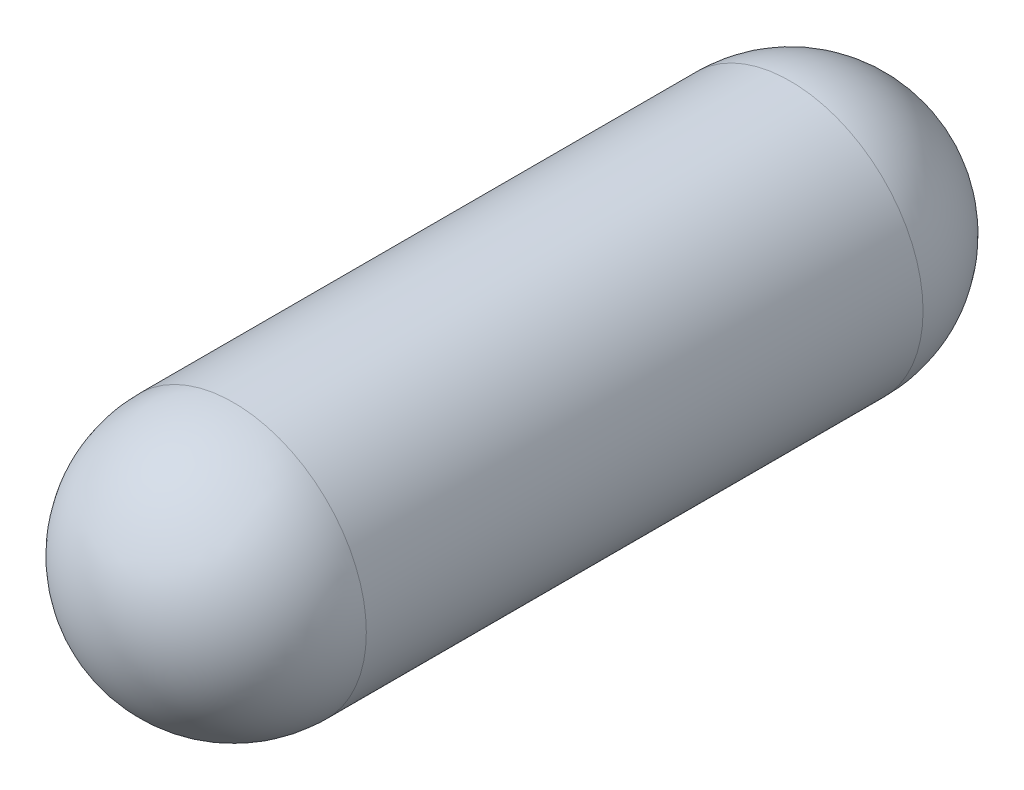
ISO-10303-21;
HEADER;
FILE_DESCRIPTION(('STEP AP214'),'2;1');
FILE_NAME('part.step','',(''),(''),'','','');
FILE_SCHEMA(('AUTOMOTIVE_DESIGN { 1 0 10303 214 1 1 1 1 }'));
ENDSEC;
DATA;
#1=APPLICATION_CONTEXT('core data for automotive mechanical design processes');
#2=APPLICATION_PROTOCOL_DEFINITION('international standard','automotive_design',2000,#1);
#3=PRODUCT_CONTEXT('',#1,'mechanical');
#4=PRODUCT('Part','Part','',(#3));
#5=PRODUCT_RELATED_PRODUCT_CATEGORY('part','',(#4));
#6=PRODUCT_DEFINITION_FORMATION('','',#4);
#7=PRODUCT_DEFINITION_CONTEXT('part definition',#1,'design');
#8=PRODUCT_DEFINITION('design','',#6,#7);
#9=PRODUCT_DEFINITION_SHAPE('','',#8);
#10=(LENGTH_UNIT() NAMED_UNIT(*) SI_UNIT(.MILLI.,.METRE.));
#11=(NAMED_UNIT(*) PLANE_ANGLE_UNIT() SI_UNIT($,.RADIAN.));
#12=(NAMED_UNIT(*) SI_UNIT($,.STERADIAN.) SOLID_ANGLE_UNIT());
#13=UNCERTAINTY_MEASURE_WITH_UNIT(LENGTH_MEASURE(1.E-05),#10,'distance_accuracy_value','');
#14=(GEOMETRIC_REPRESENTATION_CONTEXT(3) GLOBAL_UNCERTAINTY_ASSIGNED_CONTEXT((#13)) GLOBAL_UNIT_ASSIGNED_CONTEXT((#10,
#11,#12)) REPRESENTATION_CONTEXT('',''));
#15=CARTESIAN_POINT('',(0.,0.,0.));
#16=DIRECTION('',(0.,0.,1.));
#17=DIRECTION('',(1.,0.,0.));
#18=AXIS2_PLACEMENT_3D('',#15,#16,#17);
#19=CARTESIAN_POINT('',(28.,-25.,-3.));
#20=DIRECTION('',(1.,0.,0.));
#21=DIRECTION('',(0.,-1.,0.));
#22=AXIS2_PLACEMENT_3D('',#19,#20,#21);
#23=SPHERICAL_SURFACE('',#22,1.55);
#24=CARTESIAN_POINT('',(28.,-25.,-3.));
#25=DIRECTION('',(0.,0.,1.));
#26=DIRECTION('',(1.,0.,0.));
#27=AXIS2_PLACEMENT_3D('',#24,#25,#26);
#28=CIRCLE('',#27,1.55);
#29=CARTESIAN_POINT('',(29.55,-25.,-3.));
#30=VERTEX_POINT('',#29);
#31=CARTESIAN_POINT('',(26.45,-25.,-3.));
#32=VERTEX_POINT('',#31);
#33=EDGE_CURVE('E42',#30,#32,#28,.T.);
#34=ORIENTED_EDGE('',*,*,#33,.F.);
#35=CARTESIAN_POINT('',(28.,-25.,-3.));
#36=DIRECTION('',(0.,0.,1.));
#37=DIRECTION('',(1.,0.,0.));
#38=AXIS2_PLACEMENT_3D('',#35,#36,#37);
#39=CIRCLE('',#38,1.55);
#40=EDGE_CURVE('E26',#32,#30,#39,.T.);
#41=ORIENTED_EDGE('',*,*,#40,.F.);
#42=EDGE_LOOP('',(#34,#41));
#43=FACE_BOUND('',#42,.T.);
#44=ADVANCED_FACE('F17',(#43),#23,.T.);
#45=CARTESIAN_POINT('',(28.,-25.,3.5));
#46=DIRECTION('',(1.,0.,0.));
#47=DIRECTION('',(0.,1.,0.));
#48=AXIS2_PLACEMENT_3D('',#45,#46,#47);
#49=SPHERICAL_SURFACE('',#48,1.55);
#50=CARTESIAN_POINT('',(28.,-25.,3.5));
#51=DIRECTION('',(0.,0.,1.));
#52=DIRECTION('',(1.,0.,0.));
#53=AXIS2_PLACEMENT_3D('',#50,#51,#52);
#54=CIRCLE('',#53,1.55);
#55=CARTESIAN_POINT('',(29.55,-25.,3.5));
#56=VERTEX_POINT('',#55);
#57=CARTESIAN_POINT('',(26.45,-25.,3.5));
#58=VERTEX_POINT('',#57);
#59=EDGE_CURVE('E11',#56,#58,#54,.F.);
#60=ORIENTED_EDGE('',*,*,#59,.F.);
#61=CARTESIAN_POINT('',(28.,-25.,3.5));
#62=DIRECTION('',(0.,0.,1.));
#63=DIRECTION('',(1.,0.,0.));
#64=AXIS2_PLACEMENT_3D('',#61,#62,#63);
#65=CIRCLE('',#64,1.55);
#66=EDGE_CURVE('E34',#58,#56,#65,.F.);
#67=ORIENTED_EDGE('',*,*,#66,.F.);
#68=EDGE_LOOP('',(#60,#67));
#69=FACE_BOUND('',#68,.T.);
#70=ADVANCED_FACE('F49',(#69),#49,.T.);
#71=CARTESIAN_POINT('',(28.,-25.,-3.));
#72=DIRECTION('',(0.,0.,1.));
#73=DIRECTION('',(1.,0.,0.));
#74=AXIS2_PLACEMENT_3D('',#71,#72,#73);
#75=CYLINDRICAL_SURFACE('',#74,1.55);
#76=ORIENTED_EDGE('',*,*,#66,.T.);
#77=ORIENTED_EDGE('',*,*,#59,.T.);
#78=EDGE_LOOP('',(#76,#77));
#79=FACE_BOUND('',#78,.T.);
#80=ORIENTED_EDGE('',*,*,#40,.T.);
#81=ORIENTED_EDGE('',*,*,#33,.T.);
#82=EDGE_LOOP('',(#80,#81));
#83=FACE_BOUND('',#82,.T.);
#84=ADVANCED_FACE('F45',(#79,#83),#75,.T.);
#85=CLOSED_SHELL('',(#44,#70,#84));
#86=MANIFOLD_SOLID_BREP('B1',#85);
#87=ADVANCED_BREP_SHAPE_REPRESENTATION('',(#18,#86),#14);
#88=SHAPE_DEFINITION_REPRESENTATION(#9,#87);
ENDSEC;
END-ISO-10303-21;
